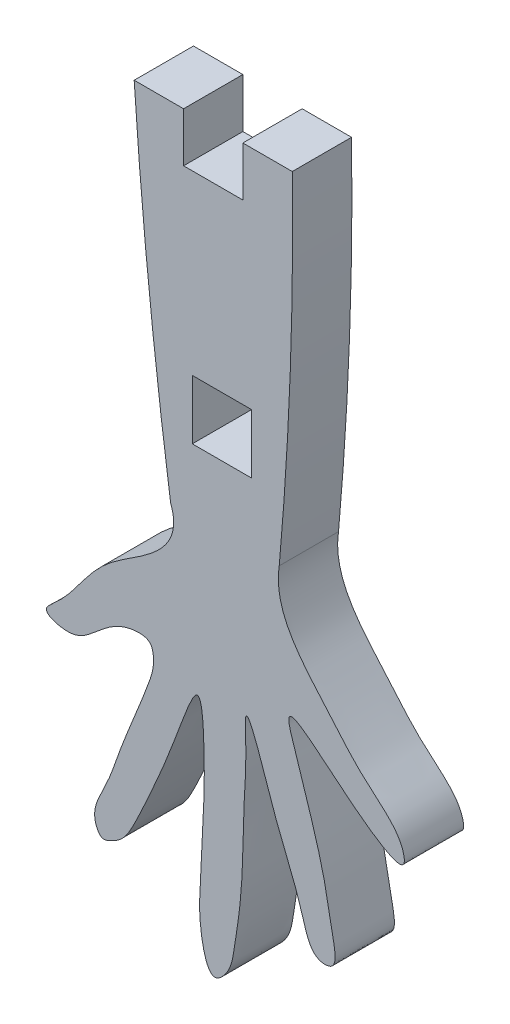
ISO-10303-21;
HEADER;
FILE_DESCRIPTION(('STEP AP214'),'2;1');
FILE_NAME('part.step','',(''),(''),'','','');
FILE_SCHEMA(('AUTOMOTIVE_DESIGN { 1 0 10303 214 1 1 1 1 }'));
ENDSEC;
DATA;
#1=APPLICATION_CONTEXT('core data for automotive mechanical design processes');
#2=APPLICATION_PROTOCOL_DEFINITION('international standard','automotive_design',2000,#1);
#3=PRODUCT_CONTEXT('',#1,'mechanical');
#4=PRODUCT('Part','Part','',(#3));
#5=PRODUCT_RELATED_PRODUCT_CATEGORY('part','',(#4));
#6=PRODUCT_DEFINITION_FORMATION('','',#4);
#7=PRODUCT_DEFINITION_CONTEXT('part definition',#1,'design');
#8=PRODUCT_DEFINITION('design','',#6,#7);
#9=PRODUCT_DEFINITION_SHAPE('','',#8);
#10=(LENGTH_UNIT() NAMED_UNIT(*) SI_UNIT(.MILLI.,.METRE.));
#11=(NAMED_UNIT(*) PLANE_ANGLE_UNIT() SI_UNIT($,.RADIAN.));
#12=(NAMED_UNIT(*) SI_UNIT($,.STERADIAN.) SOLID_ANGLE_UNIT());
#13=UNCERTAINTY_MEASURE_WITH_UNIT(LENGTH_MEASURE(1.E-05),#10,'distance_accuracy_value','');
#14=(GEOMETRIC_REPRESENTATION_CONTEXT(3) GLOBAL_UNCERTAINTY_ASSIGNED_CONTEXT((#13)) GLOBAL_UNIT_ASSIGNED_CONTEXT((#10,
#11,#12)) REPRESENTATION_CONTEXT('',''));
#15=CARTESIAN_POINT('',(0.,0.,0.));
#16=DIRECTION('',(0.,0.,1.));
#17=DIRECTION('',(1.,0.,0.));
#18=AXIS2_PLACEMENT_3D('',#15,#16,#17);
#19=CARTESIAN_POINT('',(0.,0.,3.));
#20=DIRECTION('',(0.,1.,0.));
#21=DIRECTION('',(-1.,0.,0.));
#22=AXIS2_PLACEMENT_3D('',#19,#20,#21);
#23=PLANE('',#22);
#24=DIRECTION('',(1.,0.,0.));
#25=VECTOR('',#24,1.);
#26=CARTESIAN_POINT('',(0.,0.,0.));
#27=LINE('',#26,#25);
#28=CARTESIAN_POINT('',(0.,0.,0.));
#29=VERTEX_POINT('',#28);
#30=CARTESIAN_POINT('',(2.5,0.,0.));
#31=VERTEX_POINT('',#30);
#32=EDGE_CURVE('E171',#29,#31,#27,.T.);
#33=ORIENTED_EDGE('',*,*,#32,.F.);
#34=DIRECTION('',(0.,0.,-1.));
#35=VECTOR('',#34,1.);
#36=CARTESIAN_POINT('',(0.,0.,3.));
#37=LINE('',#36,#35);
#38=CARTESIAN_POINT('',(0.,0.,3.));
#39=VERTEX_POINT('',#38);
#40=EDGE_CURVE('E11',#39,#29,#37,.T.);
#41=ORIENTED_EDGE('',*,*,#40,.F.);
#42=DIRECTION('',(1.,0.,0.));
#43=VECTOR('',#42,1.);
#44=CARTESIAN_POINT('',(0.,0.,3.));
#45=LINE('',#44,#43);
#46=CARTESIAN_POINT('',(2.5,0.,3.));
#47=VERTEX_POINT('',#46);
#48=EDGE_CURVE('E293',#39,#47,#45,.T.);
#49=ORIENTED_EDGE('',*,*,#48,.T.);
#50=DIRECTION('',(0.,0.,-1.));
#51=VECTOR('',#50,1.);
#52=CARTESIAN_POINT('',(2.5,0.,3.));
#53=LINE('',#52,#51);
#54=EDGE_CURVE('E52',#47,#31,#53,.T.);
#55=ORIENTED_EDGE('',*,*,#54,.T.);
#56=EDGE_LOOP('',(#33,#41,#49,#55));
#57=FACE_BOUND('',#56,.T.);
#58=ADVANCED_FACE('F33',(#57),#23,.T.);
#59=CARTESIAN_POINT('',(231.469652381182,15.3384722883328,3.));
#60=DIRECTION('',(0.,0.,-1.));
#61=DIRECTION('',(-1.,0.,0.));
#62=AXIS2_PLACEMENT_3D('',#59,#60,#61);
#63=CYLINDRICAL_SURFACE('',#62,231.977302134509);
#64=CARTESIAN_POINT('',(231.469652381182,15.3384722883328,0.));
#65=DIRECTION('',(0.,0.,1.));
#66=DIRECTION('',(1.,0.,0.));
#67=AXIS2_PLACEMENT_3D('',#64,#65,#66);
#68=CIRCLE('',#67,231.977302134509);
#69=CARTESIAN_POINT('',(1.84428123999325,-17.6108468833361,0.));
#70=VERTEX_POINT('',#69);
#71=EDGE_CURVE('E173',#29,#70,#68,.T.);
#72=ORIENTED_EDGE('',*,*,#71,.T.);
#73=DIRECTION('',(0.,0.,-1.));
#74=VECTOR('',#73,1.);
#75=CARTESIAN_POINT('',(1.84428123999325,-17.6108468833361,3.));
#76=LINE('',#75,#74);
#77=CARTESIAN_POINT('',(1.84428123999325,-17.6108468833361,3.));
#78=VERTEX_POINT('',#77);
#79=EDGE_CURVE('E43',#78,#70,#76,.T.);
#80=ORIENTED_EDGE('',*,*,#79,.F.);
#81=CARTESIAN_POINT('',(231.469652381182,15.3384722883328,3.));
#82=DIRECTION('',(0.,0.,1.));
#83=DIRECTION('',(1.,0.,0.));
#84=AXIS2_PLACEMENT_3D('',#81,#82,#83);
#85=CIRCLE('',#84,231.977302134509);
#86=EDGE_CURVE('E259',#39,#78,#85,.T.);
#87=ORIENTED_EDGE('',*,*,#86,.F.);
#88=ORIENTED_EDGE('',*,*,#40,.T.);
#89=EDGE_LOOP('',(#72,#80,#87,#88));
#90=FACE_BOUND('',#89,.T.);
#91=ADVANCED_FACE('F237',(#90),#63,.T.);
#92=CARTESIAN_POINT('',(1.84428123999325,-17.6108468833361,3.));
#93=CARTESIAN_POINT('',(2.36746161638156,-18.9450647064137,3.));
#94=CARTESIAN_POINT('',(0.891432490229058,-20.4729237387487,3.));
#95=CARTESIAN_POINT('',(-1.07458871466703,-21.5395336233622,3.));
#96=CARTESIAN_POINT('',(-2.60759749927204,-23.1047817839385,3.));
#97=CARTESIAN_POINT('',(-3.26116503755397,-24.3085622937617,3.));
#98=CARTESIAN_POINT('',(-4.79757270380677,-25.5577149950257,3.));
#99=CARTESIAN_POINT('',(-3.12318309984998,-26.0611869595611,3.));
#100=CARTESIAN_POINT('',(-1.85544302779327,-25.123769596692,3.));
#101=CARTESIAN_POINT('',(-0.721206203100864,-23.9962218449874,3.));
#102=CARTESIAN_POINT('',(0.783008460805677,-24.0983926883728,3.));
#103=CARTESIAN_POINT('',(1.11065424178635,-25.0161377372027,3.));
#104=CARTESIAN_POINT('',(0.419413643549028,-26.9920826405733,3.));
#105=CARTESIAN_POINT('',(-0.595526290355302,-29.2481351608243,3.));
#106=CARTESIAN_POINT('',(-1.37666969199859,-31.6837324963957,3.));
#107=CARTESIAN_POINT('',(-2.29093691815245,-33.1145573844236,3.));
#108=CARTESIAN_POINT('',(-1.63944695970907,-34.1317373389746,3.));
#109=CARTESIAN_POINT('',(-1.12194627001673,-33.8990041317711,3.));
#110=CARTESIAN_POINT('',(-0.494849332536748,-33.5414759452628,3.));
#111=CARTESIAN_POINT('',(0.0676476364167753,-32.4897719107311,3.));
#112=CARTESIAN_POINT('',(0.853189915952615,-30.7986523551523,3.));
#113=CARTESIAN_POINT('',(1.75538998956506,-28.7076818282377,3.));
#114=CARTESIAN_POINT('',(2.36055792871279,-27.0165832986913,3.));
#115=CARTESIAN_POINT('',(3.40498170868731,-24.3584925319771,3.));
#116=CARTESIAN_POINT('',(3.5812504490498,-28.121664114137,3.));
#117=CARTESIAN_POINT('',(3.51442739313383,-30.2535125468409,3.));
#118=CARTESIAN_POINT('',(3.35962500610993,-33.3206785449777,3.));
#119=CARTESIAN_POINT('',(3.24111808107281,-35.3060351519789,3.));
#120=CARTESIAN_POINT('',(3.82078156396654,-37.7775106601671,3.));
#121=CARTESIAN_POINT('',(4.89128080776458,-36.6107783673861,3.));
#122=CARTESIAN_POINT('',(5.10301395572685,-35.2426508906224,3.));
#123=CARTESIAN_POINT('',(5.40750208263094,-33.355095359464,3.));
#124=CARTESIAN_POINT('',(5.50607590727328,-31.1823680717454,3.));
#125=CARTESIAN_POINT('',(5.53872758316365,-28.7207891565483,3.));
#126=CARTESIAN_POINT('',(5.70744380201433,-27.0004534898951,3.));
#127=CARTESIAN_POINT('',(5.53057227354243,-23.8751295496286,3.));
#128=CARTESIAN_POINT('',(6.77497624999937,-27.691406959985,3.));
#129=CARTESIAN_POINT('',(7.53891552158315,-29.7899965425089,3.));
#130=CARTESIAN_POINT('',(8.39869346494562,-31.694157074631,3.));
#131=CARTESIAN_POINT('',(8.94026429092269,-33.9678283853787,3.));
#132=CARTESIAN_POINT('',(10.3729812084286,-33.8976723515376,3.));
#133=CARTESIAN_POINT('',(9.93389736722983,-32.0869700250369,3.));
#134=CARTESIAN_POINT('',(9.73159611850425,-30.6270104839616,3.));
#135=CARTESIAN_POINT('',(9.28343655818086,-28.8808028985081,3.));
#136=CARTESIAN_POINT('',(8.737002038859,-27.1507098625854,3.));
#137=CARTESIAN_POINT('',(8.29860635172846,-25.7515697160491,3.));
#138=CARTESIAN_POINT('',(7.2859494195624,-22.8417292444134,3.));
#139=CARTESIAN_POINT('',(10.4388614611892,-25.9584897227492,3.));
#140=CARTESIAN_POINT('',(13.8829571948504,-28.2542544591208,3.));
#141=CARTESIAN_POINT('',(13.5478169154317,-26.6705517724496,3.));
#142=CARTESIAN_POINT('',(12.8692777938511,-25.7753886676835,3.));
#143=CARTESIAN_POINT('',(11.3178123259484,-24.5827207979023,3.));
#144=CARTESIAN_POINT('',(9.15996637526325,-21.9209733120284,3.));
#145=CARTESIAN_POINT('',(7.02176043470476,-19.7273772177567,3.));
#146=CARTESIAN_POINT('',(7.34087386430673,-17.6108468833361,3.));
#147=B_SPLINE_CURVE_WITH_KNOTS('',3,(#92,#93,#94,#95,#96,#97,#98,#99,#100,#101,#102,#103,#104,
#105,#106,#107,#108,#109,#110,#111,#112,#113,#114,#115,#116,#117,#118,#119,#120,#121,#122,#123,
#124,#125,#126,#127,#128,#129,#130,#131,#132,#133,#134,#135,#136,#137,#138,#139,#140,#141,#142,
#143,#144,#145,#146),.UNSPECIFIED.,.F.,.F.,(4,1,1,1,1,1,1,1,1,1,1,1,1,1,1,1,1,1,1,1,1,1,1,1,1,1,
1,1,1,1,1,1,1,1,1,1,1,1,1,1,1,1,1,1,1,1,1,1,1,1,1,1,4),(0.,0.0345574036336664,0.057170592466796,
0.0681507290117475,0.0986369528424587,0.104139207740967,0.115965176720848,0.128946734381647,
0.153767299243312,0.162728251991913,0.164167146762398,0.182206391821985,0.220910801041649,
0.240003752934305,0.260619007084462,0.265391122589349,0.269659432455512,0.275164047858581,
0.287715353198886,0.303287380114351,0.3326252770684,0.351966861414053,0.366761286229577,
0.38969091502964,0.414734792861783,0.449813724268805,0.470499029196177,0.487839113883759,
0.495725811107999,0.507068990687243,0.531104133939606,0.551931171640015,0.573033244260949,
0.602577928561472,0.612823325749948,0.644235200671935,0.658343353561023,0.691154788411523,
0.709441588199291,0.713370518669489,0.728485415978663,0.746570550220392,0.765207103801786,
0.780648879629968,0.800279660269908,0.814022660381297,0.851718478889919,0.880879570241677,
0.883952598488062,0.896409812164617,0.91432849204079,0.942057881483654,1.),.UNSPECIFIED.);
#148=DIRECTION('',(0.,0.,-1.));
#149=VECTOR('',#148,1.);
#150=SURFACE_OF_LINEAR_EXTRUSION('',#147,#149);
#151=CARTESIAN_POINT('',(1.84428123999325,-17.6108468833361,0.));
#152=CARTESIAN_POINT('',(2.36746161638156,-18.9450647064137,0.));
#153=CARTESIAN_POINT('',(0.891432490229058,-20.4729237387487,0.));
#154=CARTESIAN_POINT('',(-1.07458871466703,-21.5395336233622,0.));
#155=CARTESIAN_POINT('',(-2.60759749927204,-23.1047817839385,0.));
#156=CARTESIAN_POINT('',(-3.26116503755397,-24.3085622937617,0.));
#157=CARTESIAN_POINT('',(-4.79757270380677,-25.5577149950257,0.));
#158=CARTESIAN_POINT('',(-3.12318309984998,-26.0611869595611,0.));
#159=CARTESIAN_POINT('',(-1.85544302779327,-25.123769596692,0.));
#160=CARTESIAN_POINT('',(-0.721206203100864,-23.9962218449874,0.));
#161=CARTESIAN_POINT('',(0.783008460805677,-24.0983926883728,0.));
#162=CARTESIAN_POINT('',(1.11065424178635,-25.0161377372027,0.));
#163=CARTESIAN_POINT('',(0.419413643549028,-26.9920826405733,0.));
#164=CARTESIAN_POINT('',(-0.595526290355302,-29.2481351608243,0.));
#165=CARTESIAN_POINT('',(-1.37666969199859,-31.6837324963957,0.));
#166=CARTESIAN_POINT('',(-2.29093691815245,-33.1145573844236,0.));
#167=CARTESIAN_POINT('',(-1.63944695970907,-34.1317373389746,0.));
#168=CARTESIAN_POINT('',(-1.12194627001673,-33.8990041317711,0.));
#169=CARTESIAN_POINT('',(-0.494849332536748,-33.5414759452628,0.));
#170=CARTESIAN_POINT('',(0.0676476364167753,-32.4897719107311,0.));
#171=CARTESIAN_POINT('',(0.853189915952615,-30.7986523551523,0.));
#172=CARTESIAN_POINT('',(1.75538998956506,-28.7076818282377,0.));
#173=CARTESIAN_POINT('',(2.36055792871279,-27.0165832986913,0.));
#174=CARTESIAN_POINT('',(3.40498170868731,-24.3584925319771,0.));
#175=CARTESIAN_POINT('',(3.5812504490498,-28.121664114137,0.));
#176=CARTESIAN_POINT('',(3.51442739313383,-30.2535125468409,0.));
#177=CARTESIAN_POINT('',(3.35962500610993,-33.3206785449777,0.));
#178=CARTESIAN_POINT('',(3.24111808107281,-35.3060351519789,0.));
#179=CARTESIAN_POINT('',(3.82078156396654,-37.7775106601671,0.));
#180=CARTESIAN_POINT('',(4.89128080776458,-36.6107783673861,0.));
#181=CARTESIAN_POINT('',(5.10301395572685,-35.2426508906224,0.));
#182=CARTESIAN_POINT('',(5.40750208263094,-33.355095359464,0.));
#183=CARTESIAN_POINT('',(5.50607590727328,-31.1823680717454,0.));
#184=CARTESIAN_POINT('',(5.53872758316365,-28.7207891565483,0.));
#185=CARTESIAN_POINT('',(5.70744380201433,-27.0004534898951,0.));
#186=CARTESIAN_POINT('',(5.53057227354243,-23.8751295496286,0.));
#187=CARTESIAN_POINT('',(6.77497624999937,-27.691406959985,0.));
#188=CARTESIAN_POINT('',(7.53891552158315,-29.7899965425089,0.));
#189=CARTESIAN_POINT('',(8.39869346494562,-31.694157074631,0.));
#190=CARTESIAN_POINT('',(8.94026429092269,-33.9678283853787,0.));
#191=CARTESIAN_POINT('',(10.3729812084286,-33.8976723515376,0.));
#192=CARTESIAN_POINT('',(9.93389736722983,-32.0869700250369,0.));
#193=CARTESIAN_POINT('',(9.73159611850425,-30.6270104839616,0.));
#194=CARTESIAN_POINT('',(9.28343655818086,-28.8808028985081,0.));
#195=CARTESIAN_POINT('',(8.737002038859,-27.1507098625854,0.));
#196=CARTESIAN_POINT('',(8.29860635172846,-25.7515697160491,0.));
#197=CARTESIAN_POINT('',(7.2859494195624,-22.8417292444134,0.));
#198=CARTESIAN_POINT('',(10.4388614611892,-25.9584897227492,0.));
#199=CARTESIAN_POINT('',(13.8829571948504,-28.2542544591208,0.));
#200=CARTESIAN_POINT('',(13.5478169154317,-26.6705517724496,0.));
#201=CARTESIAN_POINT('',(12.8692777938511,-25.7753886676835,0.));
#202=CARTESIAN_POINT('',(11.3178123259484,-24.5827207979023,0.));
#203=CARTESIAN_POINT('',(9.15996637526325,-21.9209733120284,0.));
#204=CARTESIAN_POINT('',(7.02176043470476,-19.7273772177567,0.));
#205=CARTESIAN_POINT('',(7.34087386430673,-17.6108468833361,0.));
#206=B_SPLINE_CURVE_WITH_KNOTS('',3,(#151,#152,#153,#154,#155,#156,#157,#158,#159,#160,#161,
#162,#163,#164,#165,#166,#167,#168,#169,#170,#171,#172,#173,#174,#175,#176,#177,#178,#179,#180,
#181,#182,#183,#184,#185,#186,#187,#188,#189,#190,#191,#192,#193,#194,#195,#196,#197,#198,#199,
#200,#201,#202,#203,#204,#205),.UNSPECIFIED.,.F.,.F.,(4,1,1,1,1,1,1,1,1,1,1,1,1,1,1,1,1,1,1,1,1,
1,1,1,1,1,1,1,1,1,1,1,1,1,1,1,1,1,1,1,1,1,1,1,1,1,1,1,1,1,1,1,4),(0.,0.0345574036336664,
0.057170592466796,0.0681507290117475,0.0986369528424587,0.104139207740967,0.115965176720848,
0.128946734381647,0.153767299243312,0.162728251991913,0.164167146762398,0.182206391821985,
0.220910801041649,0.240003752934305,0.260619007084462,0.265391122589349,0.269659432455512,
0.275164047858581,0.287715353198886,0.303287380114351,0.3326252770684,0.351966861414053,
0.366761286229577,0.38969091502964,0.414734792861783,0.449813724268805,0.470499029196177,
0.487839113883759,0.495725811107999,0.507068990687243,0.531104133939606,0.551931171640015,
0.573033244260949,0.602577928561472,0.612823325749948,0.644235200671935,0.658343353561023,
0.691154788411523,0.709441588199291,0.713370518669489,0.728485415978663,0.746570550220392,
0.765207103801786,0.780648879629968,0.800279660269908,0.814022660381297,0.851718478889919,
0.880879570241677,0.883952598488062,0.896409812164617,0.91432849204079,0.942057881483654,1.),.UNSPECIFIED.);
#207=CARTESIAN_POINT('',(7.34087386430672,-17.6108468833361,0.));
#208=VERTEX_POINT('',#207);
#209=EDGE_CURVE('E176',#70,#208,#206,.T.);
#210=ORIENTED_EDGE('',*,*,#209,.T.);
#211=DIRECTION('',(0.,0.,-1.));
#212=VECTOR('',#211,1.);
#213=CARTESIAN_POINT('',(7.34087386430672,-17.6108468833361,3.));
#214=LINE('',#213,#212);
#215=CARTESIAN_POINT('',(7.34087386430672,-17.6108468833361,3.));
#216=VERTEX_POINT('',#215);
#217=EDGE_CURVE('E202',#216,#208,#214,.T.);
#218=ORIENTED_EDGE('',*,*,#217,.F.);
#219=EDGE_CURVE('E252',#78,#216,#147,.T.);
#220=ORIENTED_EDGE('',*,*,#219,.F.);
#221=ORIENTED_EDGE('',*,*,#79,.T.);
#222=EDGE_LOOP('',(#210,#218,#220,#221));
#223=FACE_BOUND('',#222,.T.);
#224=ADVANCED_FACE('F242',(#223),#150,.F.);
#225=CARTESIAN_POINT('',(-162.223337970646,-2.44676118812329,3.));
#226=DIRECTION('',(0.,0.,-1.));
#227=DIRECTION('',(-1.,0.,0.));
#228=AXIS2_PLACEMENT_3D('',#225,#226,#227);
#229=CYLINDRICAL_SURFACE('',#228,170.240921726183);
#230=CARTESIAN_POINT('',(-162.223337970646,-2.44676118812329,0.));
#231=DIRECTION('',(0.,0.,1.));
#232=DIRECTION('',(1.,0.,0.));
#233=AXIS2_PLACEMENT_3D('',#230,#231,#232);
#234=CIRCLE('',#233,170.240921726183);
#235=CARTESIAN_POINT('',(8.,0.,0.));
#236=VERTEX_POINT('',#235);
#237=EDGE_CURVE('E181',#236,#208,#234,.F.);
#238=ORIENTED_EDGE('',*,*,#237,.F.);
#239=DIRECTION('',(0.,0.,-1.));
#240=VECTOR('',#239,1.);
#241=CARTESIAN_POINT('',(8.,0.,3.));
#242=LINE('',#241,#240);
#243=CARTESIAN_POINT('',(8.,0.,3.));
#244=VERTEX_POINT('',#243);
#245=EDGE_CURVE('E200',#244,#236,#242,.T.);
#246=ORIENTED_EDGE('',*,*,#245,.F.);
#247=CARTESIAN_POINT('',(-162.223337970646,-2.44676118812329,3.));
#248=DIRECTION('',(0.,0.,1.));
#249=DIRECTION('',(1.,0.,0.));
#250=AXIS2_PLACEMENT_3D('',#247,#248,#249);
#251=CIRCLE('',#250,170.240921726183);
#252=EDGE_CURVE('E258',#244,#216,#251,.F.);
#253=ORIENTED_EDGE('',*,*,#252,.T.);
#254=ORIENTED_EDGE('',*,*,#217,.T.);
#255=EDGE_LOOP('',(#238,#246,#253,#254));
#256=FACE_BOUND('',#255,.T.);
#257=ADVANCED_FACE('F249',(#256),#229,.T.);
#258=CARTESIAN_POINT('',(0.,0.,3.));
#259=DIRECTION('',(0.,1.,0.));
#260=DIRECTION('',(0.,0.,1.));
#261=AXIS2_PLACEMENT_3D('',#258,#259,#260);
#262=PLANE('',#261);
#263=DIRECTION('',(1.,0.,0.));
#264=VECTOR('',#263,1.);
#265=CARTESIAN_POINT('',(0.,0.,0.));
#266=LINE('',#265,#264);
#267=CARTESIAN_POINT('',(5.5,0.,0.));
#268=VERTEX_POINT('',#267);
#269=EDGE_CURVE('E187',#268,#236,#266,.T.);
#270=ORIENTED_EDGE('',*,*,#269,.F.);
#271=DIRECTION('',(0.,0.,-1.));
#272=VECTOR('',#271,1.);
#273=CARTESIAN_POINT('',(5.5,0.,3.));
#274=LINE('',#273,#272);
#275=CARTESIAN_POINT('',(5.5,0.,3.));
#276=VERTEX_POINT('',#275);
#277=EDGE_CURVE('E150',#276,#268,#274,.T.);
#278=ORIENTED_EDGE('',*,*,#277,.F.);
#279=DIRECTION('',(1.,0.,0.));
#280=VECTOR('',#279,1.);
#281=CARTESIAN_POINT('',(0.,0.,3.));
#282=LINE('',#281,#280);
#283=EDGE_CURVE('E140',#276,#244,#282,.T.);
#284=ORIENTED_EDGE('',*,*,#283,.T.);
#285=ORIENTED_EDGE('',*,*,#245,.T.);
#286=EDGE_LOOP('',(#270,#278,#284,#285));
#287=FACE_BOUND('',#286,.T.);
#288=ADVANCED_FACE('F267',(#287),#262,.T.);
#289=CARTESIAN_POINT('',(5.5,0.,3.));
#290=DIRECTION('',(1.,0.,0.));
#291=DIRECTION('',(0.,1.,0.));
#292=AXIS2_PLACEMENT_3D('',#289,#290,#291);
#293=PLANE('',#292);
#294=DIRECTION('',(0.,-1.,0.));
#295=VECTOR('',#294,1.);
#296=CARTESIAN_POINT('',(5.5,0.,0.));
#297=LINE('',#296,#295);
#298=CARTESIAN_POINT('',(5.5,-2.5,0.));
#299=VERTEX_POINT('',#298);
#300=EDGE_CURVE('E147',#268,#299,#297,.T.);
#301=ORIENTED_EDGE('',*,*,#300,.T.);
#302=DIRECTION('',(0.,0.,-1.));
#303=VECTOR('',#302,1.);
#304=CARTESIAN_POINT('',(5.5,-2.5,3.));
#305=LINE('',#304,#303);
#306=CARTESIAN_POINT('',(5.5,-2.5,3.));
#307=VERTEX_POINT('',#306);
#308=EDGE_CURVE('E144',#307,#299,#305,.T.);
#309=ORIENTED_EDGE('',*,*,#308,.F.);
#310=DIRECTION('',(0.,-1.,0.));
#311=VECTOR('',#310,1.);
#312=CARTESIAN_POINT('',(5.5,0.,3.));
#313=LINE('',#312,#311);
#314=EDGE_CURVE('E131',#276,#307,#313,.T.);
#315=ORIENTED_EDGE('',*,*,#314,.F.);
#316=ORIENTED_EDGE('',*,*,#277,.T.);
#317=EDGE_LOOP('',(#301,#309,#315,#316));
#318=FACE_BOUND('',#317,.T.);
#319=ADVANCED_FACE('F145',(#318),#293,.F.);
#320=CARTESIAN_POINT('',(0.,-2.5,3.));
#321=DIRECTION('',(0.,1.,0.));
#322=DIRECTION('',(-1.,0.,0.));
#323=AXIS2_PLACEMENT_3D('',#320,#321,#322);
#324=PLANE('',#323);
#325=DIRECTION('',(1.,0.,0.));
#326=VECTOR('',#325,1.);
#327=CARTESIAN_POINT('',(0.,-2.5,0.));
#328=LINE('',#327,#326);
#329=CARTESIAN_POINT('',(2.5,-2.5,0.));
#330=VERTEX_POINT('',#329);
#331=EDGE_CURVE('E191',#330,#299,#328,.T.);
#332=ORIENTED_EDGE('',*,*,#331,.F.);
#333=DIRECTION('',(0.,0.,-1.));
#334=VECTOR('',#333,1.);
#335=CARTESIAN_POINT('',(2.5,-2.5,3.));
#336=LINE('',#335,#334);
#337=CARTESIAN_POINT('',(2.5,-2.5,3.));
#338=VERTEX_POINT('',#337);
#339=EDGE_CURVE('E89',#338,#330,#336,.T.);
#340=ORIENTED_EDGE('',*,*,#339,.F.);
#341=DIRECTION('',(1.,0.,0.));
#342=VECTOR('',#341,1.);
#343=CARTESIAN_POINT('',(0.,-2.5,3.));
#344=LINE('',#343,#342);
#345=EDGE_CURVE('E137',#338,#307,#344,.T.);
#346=ORIENTED_EDGE('',*,*,#345,.T.);
#347=ORIENTED_EDGE('',*,*,#308,.T.);
#348=EDGE_LOOP('',(#332,#340,#346,#347));
#349=FACE_BOUND('',#348,.T.);
#350=ADVANCED_FACE('F152',(#349),#324,.T.);
#351=CARTESIAN_POINT('',(0.,-11.4653454890776,3.));
#352=DIRECTION('',(0.,1.,0.));
#353=DIRECTION('',(-1.,0.,0.));
#354=AXIS2_PLACEMENT_3D('',#351,#352,#353);
#355=PLANE('',#354);
#356=DIRECTION('',(1.,0.,0.));
#357=VECTOR('',#356,1.);
#358=CARTESIAN_POINT('',(0.,-11.4653454890776,0.));
#359=LINE('',#358,#357);
#360=CARTESIAN_POINT('',(2.94087386430672,-11.4653454890776,0.));
#361=VERTEX_POINT('',#360);
#362=CARTESIAN_POINT('',(5.94087386430672,-11.4653454890776,0.));
#363=VERTEX_POINT('',#362);
#364=EDGE_CURVE('E159',#361,#363,#359,.T.);
#365=ORIENTED_EDGE('',*,*,#364,.T.);
#366=DIRECTION('',(0.,0.,-1.));
#367=VECTOR('',#366,1.);
#368=CARTESIAN_POINT('',(5.94087386430672,-11.4653454890776,3.));
#369=LINE('',#368,#367);
#370=CARTESIAN_POINT('',(5.94087386430672,-11.4653454890776,3.));
#371=VERTEX_POINT('',#370);
#372=EDGE_CURVE('E37',#371,#363,#369,.T.);
#373=ORIENTED_EDGE('',*,*,#372,.F.);
#374=DIRECTION('',(1.,0.,0.));
#375=VECTOR('',#374,1.);
#376=CARTESIAN_POINT('',(0.,-11.4653454890776,3.));
#377=LINE('',#376,#375);
#378=CARTESIAN_POINT('',(2.94087386430672,-11.4653454890776,3.));
#379=VERTEX_POINT('',#378);
#380=EDGE_CURVE('E196',#379,#371,#377,.T.);
#381=ORIENTED_EDGE('',*,*,#380,.F.);
#382=DIRECTION('',(0.,0.,-1.));
#383=VECTOR('',#382,1.);
#384=CARTESIAN_POINT('',(2.94087386430672,-11.4653454890776,3.));
#385=LINE('',#384,#383);
#386=EDGE_CURVE('E155',#379,#361,#385,.T.);
#387=ORIENTED_EDGE('',*,*,#386,.T.);
#388=EDGE_LOOP('',(#365,#373,#381,#387));
#389=FACE_BOUND('',#388,.T.);
#390=ADVANCED_FACE('F35',(#389),#355,.F.);
#391=CARTESIAN_POINT('',(5.94087386430672,0.,3.));
#392=DIRECTION('',(1.,0.,0.));
#393=DIRECTION('',(0.,0.,-1.));
#394=AXIS2_PLACEMENT_3D('',#391,#392,#393);
#395=PLANE('',#394);
#396=DIRECTION('',(0.,-1.,0.));
#397=VECTOR('',#396,1.);
#398=CARTESIAN_POINT('',(5.94087386430672,0.,0.));
#399=LINE('',#398,#397);
#400=CARTESIAN_POINT('',(5.94087386430672,-14.4653454890776,0.));
#401=VERTEX_POINT('',#400);
#402=EDGE_CURVE('E162',#363,#401,#399,.T.);
#403=ORIENTED_EDGE('',*,*,#402,.T.);
#404=DIRECTION('',(0.,0.,-1.));
#405=VECTOR('',#404,1.);
#406=CARTESIAN_POINT('',(5.94087386430672,-14.4653454890776,3.));
#407=LINE('',#406,#405);
#408=CARTESIAN_POINT('',(5.94087386430672,-14.4653454890776,3.));
#409=VERTEX_POINT('',#408);
#410=EDGE_CURVE('E208',#409,#401,#407,.T.);
#411=ORIENTED_EDGE('',*,*,#410,.F.);
#412=DIRECTION('',(0.,-1.,0.));
#413=VECTOR('',#412,1.);
#414=CARTESIAN_POINT('',(5.94087386430672,0.,3.));
#415=LINE('',#414,#413);
#416=EDGE_CURVE('E102',#371,#409,#415,.T.);
#417=ORIENTED_EDGE('',*,*,#416,.F.);
#418=ORIENTED_EDGE('',*,*,#372,.T.);
#419=EDGE_LOOP('',(#403,#411,#417,#418));
#420=FACE_BOUND('',#419,.T.);
#421=ADVANCED_FACE('F213',(#420),#395,.F.);
#422=CARTESIAN_POINT('',(0.,-14.4653454890776,3.));
#423=DIRECTION('',(0.,1.,0.));
#424=DIRECTION('',(-1.,0.,0.));
#425=AXIS2_PLACEMENT_3D('',#422,#423,#424);
#426=PLANE('',#425);
#427=DIRECTION('',(1.,0.,0.));
#428=VECTOR('',#427,1.);
#429=CARTESIAN_POINT('',(0.,-14.4653454890776,0.));
#430=LINE('',#429,#428);
#431=CARTESIAN_POINT('',(2.94087386430672,-14.4653454890776,0.));
#432=VERTEX_POINT('',#431);
#433=EDGE_CURVE('E165',#432,#401,#430,.T.);
#434=ORIENTED_EDGE('',*,*,#433,.F.);
#435=DIRECTION('',(0.,0.,-1.));
#436=VECTOR('',#435,1.);
#437=CARTESIAN_POINT('',(2.94087386430672,-14.4653454890776,3.));
#438=LINE('',#437,#436);
#439=CARTESIAN_POINT('',(2.94087386430672,-14.4653454890776,3.));
#440=VERTEX_POINT('',#439);
#441=EDGE_CURVE('E207',#440,#432,#438,.T.);
#442=ORIENTED_EDGE('',*,*,#441,.F.);
#443=DIRECTION('',(1.,0.,0.));
#444=VECTOR('',#443,1.);
#445=CARTESIAN_POINT('',(0.,-14.4653454890776,3.));
#446=LINE('',#445,#444);
#447=EDGE_CURVE('E294',#440,#409,#446,.T.);
#448=ORIENTED_EDGE('',*,*,#447,.T.);
#449=ORIENTED_EDGE('',*,*,#410,.T.);
#450=EDGE_LOOP('',(#434,#442,#448,#449));
#451=FACE_BOUND('',#450,.T.);
#452=ADVANCED_FACE('F227',(#451),#426,.T.);
#453=CARTESIAN_POINT('',(2.94087386430672,0.,3.));
#454=DIRECTION('',(1.,0.,0.));
#455=DIRECTION('',(0.,1.,0.));
#456=AXIS2_PLACEMENT_3D('',#453,#454,#455);
#457=PLANE('',#456);
#458=DIRECTION('',(0.,-1.,0.));
#459=VECTOR('',#458,1.);
#460=CARTESIAN_POINT('',(2.94087386430672,0.,0.));
#461=LINE('',#460,#459);
#462=EDGE_CURVE('E168',#361,#432,#461,.T.);
#463=ORIENTED_EDGE('',*,*,#462,.F.);
#464=ORIENTED_EDGE('',*,*,#386,.F.);
#465=DIRECTION('',(0.,-1.,0.));
#466=VECTOR('',#465,1.);
#467=CARTESIAN_POINT('',(2.94087386430672,0.,3.));
#468=LINE('',#467,#466);
#469=EDGE_CURVE('E225',#379,#440,#468,.T.);
#470=ORIENTED_EDGE('',*,*,#469,.T.);
#471=ORIENTED_EDGE('',*,*,#441,.T.);
#472=EDGE_LOOP('',(#463,#464,#470,#471));
#473=FACE_BOUND('',#472,.T.);
#474=ADVANCED_FACE('F222',(#473),#457,.T.);
#475=CARTESIAN_POINT('',(2.5,0.,3.));
#476=DIRECTION('',(1.,0.,0.));
#477=DIRECTION('',(0.,1.,0.));
#478=AXIS2_PLACEMENT_3D('',#475,#476,#477);
#479=PLANE('',#478);
#480=DIRECTION('',(0.,-1.,0.));
#481=VECTOR('',#480,1.);
#482=CARTESIAN_POINT('',(2.5,0.,0.));
#483=LINE('',#482,#481);
#484=EDGE_CURVE('E193',#31,#330,#483,.T.);
#485=ORIENTED_EDGE('',*,*,#484,.F.);
#486=ORIENTED_EDGE('',*,*,#54,.F.);
#487=DIRECTION('',(0.,-1.,0.));
#488=VECTOR('',#487,1.);
#489=CARTESIAN_POINT('',(2.5,0.,3.));
#490=LINE('',#489,#488);
#491=EDGE_CURVE('E153',#47,#338,#490,.T.);
#492=ORIENTED_EDGE('',*,*,#491,.T.);
#493=ORIENTED_EDGE('',*,*,#339,.T.);
#494=EDGE_LOOP('',(#485,#486,#492,#493));
#495=FACE_BOUND('',#494,.T.);
#496=ADVANCED_FACE('F234',(#495),#479,.T.);
#497=CARTESIAN_POINT('',(0.,0.,3.));
#498=DIRECTION('',(0.,0.,1.));
#499=DIRECTION('',(1.,0.,0.));
#500=AXIS2_PLACEMENT_3D('',#497,#498,#499);
#501=PLANE('',#500);
#502=ORIENTED_EDGE('',*,*,#380,.T.);
#503=ORIENTED_EDGE('',*,*,#416,.T.);
#504=ORIENTED_EDGE('',*,*,#447,.F.);
#505=ORIENTED_EDGE('',*,*,#469,.F.);
#506=EDGE_LOOP('',(#502,#503,#504,#505));
#507=FACE_BOUND('',#506,.T.);
#508=ORIENTED_EDGE('',*,*,#48,.F.);
#509=ORIENTED_EDGE('',*,*,#86,.T.);
#510=ORIENTED_EDGE('',*,*,#219,.T.);
#511=ORIENTED_EDGE('',*,*,#252,.F.);
#512=ORIENTED_EDGE('',*,*,#283,.F.);
#513=ORIENTED_EDGE('',*,*,#314,.T.);
#514=ORIENTED_EDGE('',*,*,#345,.F.);
#515=ORIENTED_EDGE('',*,*,#491,.F.);
#516=EDGE_LOOP('',(#508,#509,#510,#511,#512,#513,#514,#515));
#517=FACE_BOUND('',#516,.T.);
#518=ADVANCED_FACE('F134',(#507,#517),#501,.T.);
#519=CARTESIAN_POINT('',(0.,0.,0.));
#520=DIRECTION('',(0.,0.,1.));
#521=DIRECTION('',(1.,0.,0.));
#522=AXIS2_PLACEMENT_3D('',#519,#520,#521);
#523=PLANE('',#522);
#524=ORIENTED_EDGE('',*,*,#364,.F.);
#525=ORIENTED_EDGE('',*,*,#462,.T.);
#526=ORIENTED_EDGE('',*,*,#433,.T.);
#527=ORIENTED_EDGE('',*,*,#402,.F.);
#528=EDGE_LOOP('',(#524,#525,#526,#527));
#529=FACE_BOUND('',#528,.T.);
#530=ORIENTED_EDGE('',*,*,#32,.T.);
#531=ORIENTED_EDGE('',*,*,#484,.T.);
#532=ORIENTED_EDGE('',*,*,#331,.T.);
#533=ORIENTED_EDGE('',*,*,#300,.F.);
#534=ORIENTED_EDGE('',*,*,#269,.T.);
#535=ORIENTED_EDGE('',*,*,#237,.T.);
#536=ORIENTED_EDGE('',*,*,#209,.F.);
#537=ORIENTED_EDGE('',*,*,#71,.F.);
#538=EDGE_LOOP('',(#530,#531,#532,#533,#534,#535,#536,#537));
#539=FACE_BOUND('',#538,.T.);
#540=ADVANCED_FACE('F219',(#529,#539),#523,.F.);
#541=CLOSED_SHELL('',(#58,#91,#224,#257,#288,#319,#350,#390,#421,#452,#474,#496,#518,#540));
#542=MANIFOLD_SOLID_BREP('B2',#541);
#543=ADVANCED_BREP_SHAPE_REPRESENTATION('',(#18,#542),#14);
#544=SHAPE_DEFINITION_REPRESENTATION(#9,#543);
ENDSEC;
END-ISO-10303-21;
